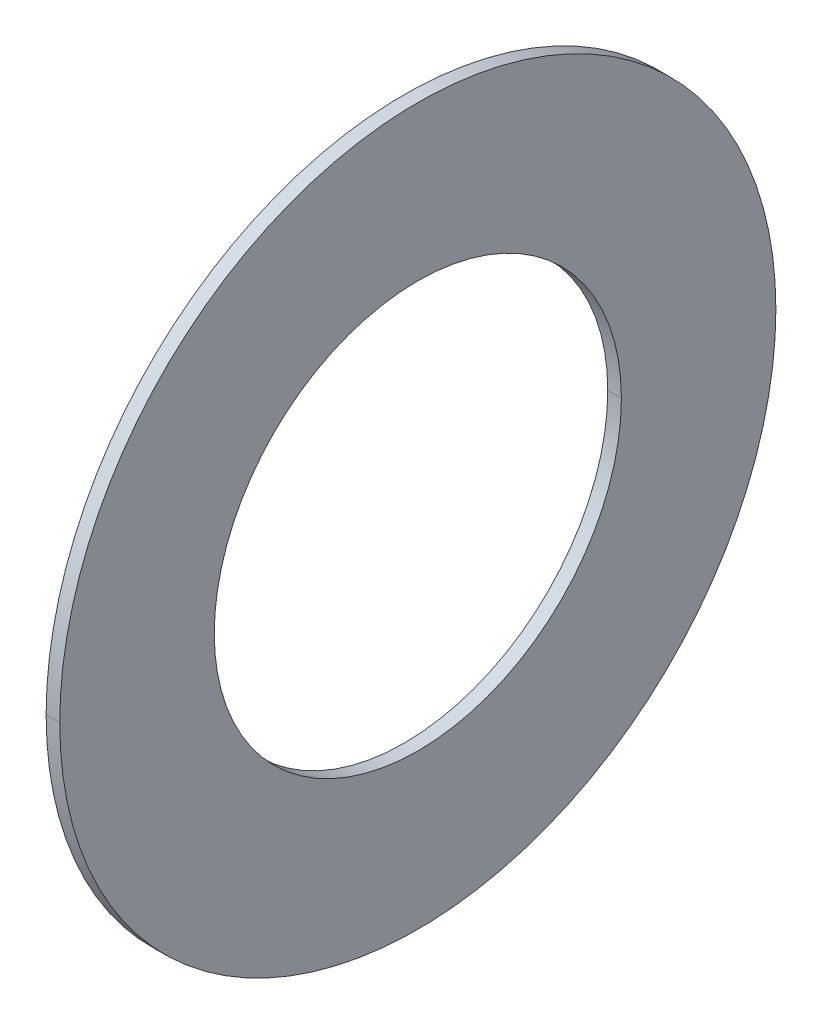
ISO-10303-21;
HEADER;
FILE_DESCRIPTION(('STEP AP214'),'2;1');
FILE_NAME('part.step','',(''),(''),'','','');
FILE_SCHEMA(('AUTOMOTIVE_DESIGN { 1 0 10303 214 1 1 1 1 }'));
ENDSEC;
DATA;
#1=APPLICATION_CONTEXT('core data for automotive mechanical design processes');
#2=APPLICATION_PROTOCOL_DEFINITION('international standard','automotive_design',2000,#1);
#3=PRODUCT_CONTEXT('',#1,'mechanical');
#4=PRODUCT('Part','Part','',(#3));
#5=PRODUCT_RELATED_PRODUCT_CATEGORY('part','',(#4));
#6=PRODUCT_DEFINITION_FORMATION('','',#4);
#7=PRODUCT_DEFINITION_CONTEXT('part definition',#1,'design');
#8=PRODUCT_DEFINITION('design','',#6,#7);
#9=PRODUCT_DEFINITION_SHAPE('','',#8);
#10=(LENGTH_UNIT() NAMED_UNIT(*) SI_UNIT(.MILLI.,.METRE.));
#11=(NAMED_UNIT(*) PLANE_ANGLE_UNIT() SI_UNIT($,.RADIAN.));
#12=(NAMED_UNIT(*) SI_UNIT($,.STERADIAN.) SOLID_ANGLE_UNIT());
#13=UNCERTAINTY_MEASURE_WITH_UNIT(LENGTH_MEASURE(1.E-05),#10,'distance_accuracy_value','');
#14=(GEOMETRIC_REPRESENTATION_CONTEXT(3) GLOBAL_UNCERTAINTY_ASSIGNED_CONTEXT((#13)) GLOBAL_UNIT_ASSIGNED_CONTEXT((#10,
#11,#12)) REPRESENTATION_CONTEXT('',''));
#15=CARTESIAN_POINT('',(0.,0.,0.));
#16=DIRECTION('',(0.,0.,1.));
#17=DIRECTION('',(1.,0.,0.));
#18=AXIS2_PLACEMENT_3D('',#15,#16,#17);
#19=CARTESIAN_POINT('',(3.75,4.925,0.));
#20=DIRECTION('',(-1.,0.,0.));
#21=DIRECTION('',(0.,0.,1.));
#22=AXIS2_PLACEMENT_3D('',#19,#20,#21);
#23=PLANE('',#22);
#24=CARTESIAN_POINT('',(3.75,0.,0.));
#25=DIRECTION('',(1.,0.,0.));
#26=DIRECTION('',(0.,0.,-1.));
#27=AXIS2_PLACEMENT_3D('',#24,#25,#26);
#28=CIRCLE('',#27,2.8);
#29=CARTESIAN_POINT('',(3.75,0.,-2.8));
#30=VERTEX_POINT('',#29);
#31=CARTESIAN_POINT('',(3.75,0.,2.8));
#32=VERTEX_POINT('',#31);
#33=EDGE_CURVE('E11',#30,#32,#28,.T.);
#34=ORIENTED_EDGE('',*,*,#33,.T.);
#35=CARTESIAN_POINT('',(3.75,0.,0.));
#36=DIRECTION('',(1.,0.,0.));
#37=DIRECTION('',(0.,0.,-1.));
#38=AXIS2_PLACEMENT_3D('',#35,#36,#37);
#39=CIRCLE('',#38,2.8);
#40=EDGE_CURVE('E25',#32,#30,#39,.T.);
#41=ORIENTED_EDGE('',*,*,#40,.T.);
#42=EDGE_LOOP('',(#34,#41));
#43=FACE_BOUND('',#42,.T.);
#44=CARTESIAN_POINT('',(3.75,0.,0.));
#45=DIRECTION('',(1.,0.,0.));
#46=DIRECTION('',(0.,0.,-1.));
#47=AXIS2_PLACEMENT_3D('',#44,#45,#46);
#48=CIRCLE('',#47,4.925);
#49=CARTESIAN_POINT('',(3.75,0.,-4.925));
#50=VERTEX_POINT('',#49);
#51=CARTESIAN_POINT('',(3.75,0.,4.925));
#52=VERTEX_POINT('',#51);
#53=EDGE_CURVE('E96',#50,#52,#48,.T.);
#54=ORIENTED_EDGE('',*,*,#53,.F.);
#55=CARTESIAN_POINT('',(3.75,0.,0.));
#56=DIRECTION('',(1.,0.,0.));
#57=DIRECTION('',(0.,0.,-1.));
#58=AXIS2_PLACEMENT_3D('',#55,#56,#57);
#59=CIRCLE('',#58,4.925);
#60=EDGE_CURVE('E91',#52,#50,#59,.T.);
#61=ORIENTED_EDGE('',*,*,#60,.F.);
#62=EDGE_LOOP('',(#54,#61));
#63=FACE_BOUND('',#62,.T.);
#64=ADVANCED_FACE('F17',(#43,#63),#23,.T.);
#65=CARTESIAN_POINT('',(3.9374,0.,0.));
#66=DIRECTION('',(-1.,0.,0.));
#67=DIRECTION('',(0.,1.,0.));
#68=AXIS2_PLACEMENT_3D('',#65,#66,#67);
#69=CYLINDRICAL_SURFACE('',#68,4.925);
#70=ORIENTED_EDGE('',*,*,#60,.T.);
#71=DIRECTION('',(-1.,0.,0.));
#72=VECTOR('',#71,1.);
#73=CARTESIAN_POINT('',(3.9374,0.,-4.925));
#74=LINE('',#73,#72);
#75=CARTESIAN_POINT('',(3.9374,0.,-4.925));
#76=VERTEX_POINT('',#75);
#77=EDGE_CURVE('E86',#76,#50,#74,.T.);
#78=ORIENTED_EDGE('',*,*,#77,.F.);
#79=CARTESIAN_POINT('',(3.9374,0.,0.));
#80=DIRECTION('',(1.,0.,0.));
#81=DIRECTION('',(0.,0.,-1.));
#82=AXIS2_PLACEMENT_3D('',#79,#80,#81);
#83=CIRCLE('',#82,4.925);
#84=CARTESIAN_POINT('',(3.9374,0.,4.925));
#85=VERTEX_POINT('',#84);
#86=EDGE_CURVE('E81',#85,#76,#83,.T.);
#87=ORIENTED_EDGE('',*,*,#86,.F.);
#88=DIRECTION('',(-1.,0.,0.));
#89=VECTOR('',#88,1.);
#90=CARTESIAN_POINT('',(3.9374,0.,4.925));
#91=LINE('',#90,#89);
#92=EDGE_CURVE('E70',#85,#52,#91,.T.);
#93=ORIENTED_EDGE('',*,*,#92,.T.);
#94=EDGE_LOOP('',(#70,#78,#87,#93));
#95=FACE_BOUND('',#94,.T.);
#96=ADVANCED_FACE('F111',(#95),#69,.T.);
#97=CARTESIAN_POINT('',(3.9374,0.,0.));
#98=DIRECTION('',(-1.,0.,0.));
#99=DIRECTION('',(0.,-1.,0.));
#100=AXIS2_PLACEMENT_3D('',#97,#98,#99);
#101=CYLINDRICAL_SURFACE('',#100,4.925);
#102=CARTESIAN_POINT('',(3.9374,0.,0.));
#103=DIRECTION('',(1.,0.,0.));
#104=DIRECTION('',(0.,0.,-1.));
#105=AXIS2_PLACEMENT_3D('',#102,#103,#104);
#106=CIRCLE('',#105,4.925);
#107=EDGE_CURVE('E67',#76,#85,#106,.T.);
#108=ORIENTED_EDGE('',*,*,#107,.F.);
#109=ORIENTED_EDGE('',*,*,#77,.T.);
#110=ORIENTED_EDGE('',*,*,#53,.T.);
#111=ORIENTED_EDGE('',*,*,#92,.F.);
#112=EDGE_LOOP('',(#108,#109,#110,#111));
#113=FACE_BOUND('',#112,.T.);
#114=ADVANCED_FACE('F108',(#113),#101,.T.);
#115=CARTESIAN_POINT('',(3.9374,2.8,0.));
#116=DIRECTION('',(1.,0.,0.));
#117=DIRECTION('',(0.,0.,-1.));
#118=AXIS2_PLACEMENT_3D('',#115,#116,#117);
#119=PLANE('',#118);
#120=ORIENTED_EDGE('',*,*,#107,.T.);
#121=ORIENTED_EDGE('',*,*,#86,.T.);
#122=EDGE_LOOP('',(#120,#121));
#123=FACE_BOUND('',#122,.T.);
#124=CARTESIAN_POINT('',(3.9374,0.,0.));
#125=DIRECTION('',(1.,0.,0.));
#126=DIRECTION('',(0.,0.,-1.));
#127=AXIS2_PLACEMENT_3D('',#124,#125,#126);
#128=CIRCLE('',#127,2.8);
#129=CARTESIAN_POINT('',(3.9374,0.,-2.8));
#130=VERTEX_POINT('',#129);
#131=CARTESIAN_POINT('',(3.9374,0.,2.8));
#132=VERTEX_POINT('',#131);
#133=EDGE_CURVE('E56',#130,#132,#128,.T.);
#134=ORIENTED_EDGE('',*,*,#133,.F.);
#135=CARTESIAN_POINT('',(3.9374,0.,0.));
#136=DIRECTION('',(1.,0.,0.));
#137=DIRECTION('',(0.,0.,-1.));
#138=AXIS2_PLACEMENT_3D('',#135,#136,#137);
#139=CIRCLE('',#138,2.8);
#140=EDGE_CURVE('E52',#132,#130,#139,.T.);
#141=ORIENTED_EDGE('',*,*,#140,.F.);
#142=EDGE_LOOP('',(#134,#141));
#143=FACE_BOUND('',#142,.T.);
#144=ADVANCED_FACE('F54',(#123,#143),#119,.T.);
#145=CARTESIAN_POINT('',(3.9374,0.,0.));
#146=DIRECTION('',(-1.,0.,0.));
#147=DIRECTION('',(0.,1.,0.));
#148=AXIS2_PLACEMENT_3D('',#145,#146,#147);
#149=CYLINDRICAL_SURFACE('',#148,2.8);
#150=ORIENTED_EDGE('',*,*,#40,.F.);
#151=DIRECTION('',(-1.,0.,0.));
#152=VECTOR('',#151,1.);
#153=CARTESIAN_POINT('',(3.9374,0.,2.8));
#154=LINE('',#153,#152);
#155=EDGE_CURVE('E59',#132,#32,#154,.T.);
#156=ORIENTED_EDGE('',*,*,#155,.F.);
#157=ORIENTED_EDGE('',*,*,#140,.T.);
#158=DIRECTION('',(-1.,0.,0.));
#159=VECTOR('',#158,1.);
#160=CARTESIAN_POINT('',(3.9374,0.,-2.8));
#161=LINE('',#160,#159);
#162=EDGE_CURVE('E64',#130,#30,#161,.T.);
#163=ORIENTED_EDGE('',*,*,#162,.T.);
#164=EDGE_LOOP('',(#150,#156,#157,#163));
#165=FACE_BOUND('',#164,.T.);
#166=ADVANCED_FACE('F62',(#165),#149,.F.);
#167=CARTESIAN_POINT('',(3.9374,0.,0.));
#168=DIRECTION('',(-1.,0.,0.));
#169=DIRECTION('',(0.,-1.,0.));
#170=AXIS2_PLACEMENT_3D('',#167,#168,#169);
#171=CYLINDRICAL_SURFACE('',#170,2.8);
#172=ORIENTED_EDGE('',*,*,#133,.T.);
#173=ORIENTED_EDGE('',*,*,#155,.T.);
#174=ORIENTED_EDGE('',*,*,#33,.F.);
#175=ORIENTED_EDGE('',*,*,#162,.F.);
#176=EDGE_LOOP('',(#172,#173,#174,#175));
#177=FACE_BOUND('',#176,.T.);
#178=ADVANCED_FACE('F66',(#177),#171,.F.);
#179=CLOSED_SHELL('',(#64,#96,#114,#144,#166,#178));
#180=MANIFOLD_SOLID_BREP('B1',#179);
#181=ADVANCED_BREP_SHAPE_REPRESENTATION('',(#18,#180),#14);
#182=SHAPE_DEFINITION_REPRESENTATION(#9,#181);
ENDSEC;
END-ISO-10303-21;
